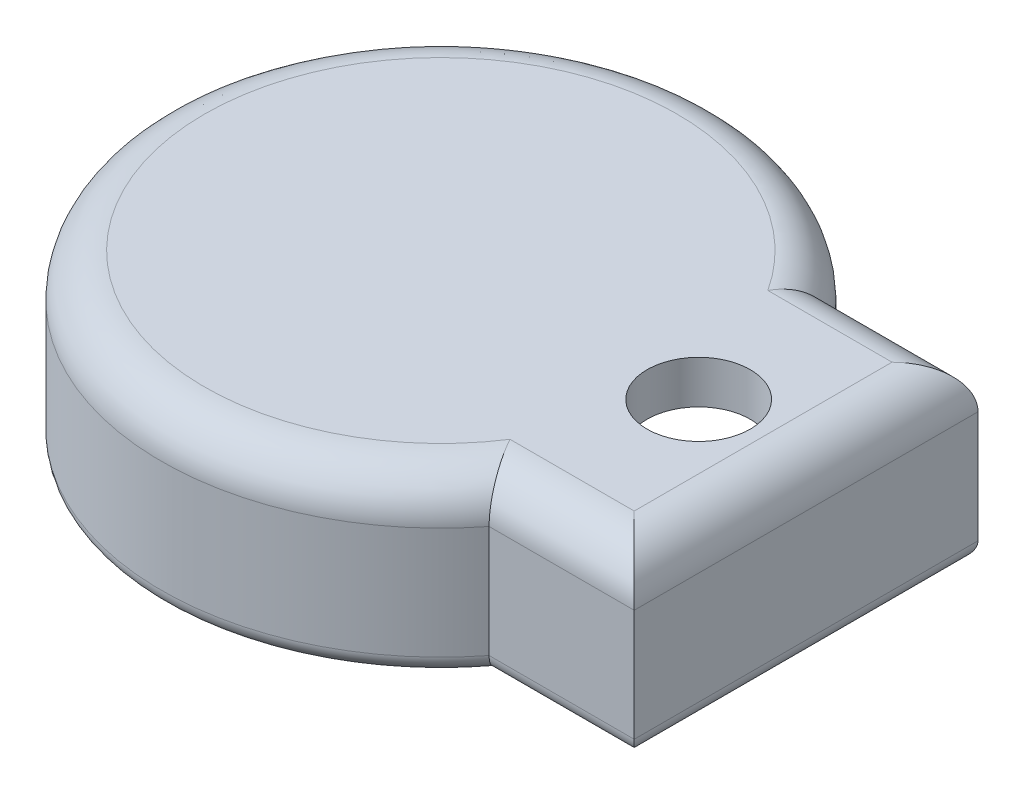
ISO-10303-21;
HEADER;
FILE_DESCRIPTION(('STEP AP214'),'2;1');
FILE_NAME('part.step','',(''),(''),'','','');
FILE_SCHEMA(('AUTOMOTIVE_DESIGN { 1 0 10303 214 1 1 1 1 }'));
ENDSEC;
DATA;
#1=APPLICATION_CONTEXT('core data for automotive mechanical design processes');
#2=APPLICATION_PROTOCOL_DEFINITION('international standard','automotive_design',2000,#1);
#3=PRODUCT_CONTEXT('',#1,'mechanical');
#4=PRODUCT('Part','Part','',(#3));
#5=PRODUCT_RELATED_PRODUCT_CATEGORY('part','',(#4));
#6=PRODUCT_DEFINITION_FORMATION('','',#4);
#7=PRODUCT_DEFINITION_CONTEXT('part definition',#1,'design');
#8=PRODUCT_DEFINITION('design','',#6,#7);
#9=PRODUCT_DEFINITION_SHAPE('','',#8);
#10=(LENGTH_UNIT() NAMED_UNIT(*) SI_UNIT(.MILLI.,.METRE.));
#11=(NAMED_UNIT(*) PLANE_ANGLE_UNIT() SI_UNIT($,.RADIAN.));
#12=(NAMED_UNIT(*) SI_UNIT($,.STERADIAN.) SOLID_ANGLE_UNIT());
#13=UNCERTAINTY_MEASURE_WITH_UNIT(LENGTH_MEASURE(1.E-05),#10,'distance_accuracy_value','');
#14=(GEOMETRIC_REPRESENTATION_CONTEXT(3) GLOBAL_UNCERTAINTY_ASSIGNED_CONTEXT((#13)) GLOBAL_UNIT_ASSIGNED_CONTEXT((#10,
#11,#12)) REPRESENTATION_CONTEXT('',''));
#15=CARTESIAN_POINT('',(0.,0.,0.));
#16=DIRECTION('',(0.,0.,1.));
#17=DIRECTION('',(1.,0.,0.));
#18=AXIS2_PLACEMENT_3D('',#15,#16,#17);
#19=CARTESIAN_POINT('',(0.,15.,-15.));
#20=DIRECTION('',(0.,0.,-1.));
#21=DIRECTION('',(-1.,0.,0.));
#22=AXIS2_PLACEMENT_3D('',#19,#20,#21);
#23=PLANE('',#22);
#24=DIRECTION('',(0.,-1.,0.));
#25=VECTOR('',#24,1.);
#26=CARTESIAN_POINT('',(23.0488611432322,15.,-15.));
#27=LINE('',#26,#25);
#28=CARTESIAN_POINT('',(23.0488611432322,15.,-15.));
#29=VERTEX_POINT('',#28);
#30=CARTESIAN_POINT('',(23.0488611432322,2.,-15.));
#31=VERTEX_POINT('',#30);
#32=EDGE_CURVE('E154',#29,#31,#27,.T.);
#33=ORIENTED_EDGE('',*,*,#32,.T.);
#34=DIRECTION('',(1.,0.,0.));
#35=VECTOR('',#34,1.);
#36=CARTESIAN_POINT('',(0.,2.,-15.));
#37=LINE('',#36,#35);
#38=CARTESIAN_POINT('',(37.5,2.,-15.));
#39=VERTEX_POINT('',#38);
#40=EDGE_CURVE('E356',#31,#39,#37,.T.);
#41=ORIENTED_EDGE('',*,*,#40,.T.);
#42=DIRECTION('',(0.,-1.,0.));
#43=VECTOR('',#42,1.);
#44=CARTESIAN_POINT('',(37.5,15.,-15.));
#45=LINE('',#44,#43);
#46=CARTESIAN_POINT('',(37.5,15.,-15.));
#47=VERTEX_POINT('',#46);
#48=EDGE_CURVE('E164',#47,#39,#45,.T.);
#49=ORIENTED_EDGE('',*,*,#48,.F.);
#50=DIRECTION('',(1.,0.,0.));
#51=VECTOR('',#50,1.);
#52=CARTESIAN_POINT('',(0.,15.,-15.));
#53=LINE('',#52,#51);
#54=EDGE_CURVE('E144',#29,#47,#53,.T.);
#55=ORIENTED_EDGE('',*,*,#54,.F.);
#56=EDGE_LOOP('',(#33,#41,#49,#55));
#57=FACE_BOUND('',#56,.T.);
#58=ADVANCED_FACE('F36',(#57),#23,.F.);
#59=CARTESIAN_POINT('',(37.5,15.,0.));
#60=DIRECTION('',(-1.,0.,0.));
#61=DIRECTION('',(0.,0.,1.));
#62=AXIS2_PLACEMENT_3D('',#59,#60,#61);
#63=PLANE('',#62);
#64=ORIENTED_EDGE('',*,*,#48,.T.);
#65=DIRECTION('',(0.,0.,-1.));
#66=VECTOR('',#65,1.);
#67=CARTESIAN_POINT('',(37.5,2.,15.));
#68=LINE('',#67,#66);
#69=CARTESIAN_POINT('',(37.5,2.,15.));
#70=VERTEX_POINT('',#69);
#71=EDGE_CURVE('E369',#39,#70,#68,.F.);
#72=ORIENTED_EDGE('',*,*,#71,.T.);
#73=DIRECTION('',(0.,-1.,0.));
#74=VECTOR('',#73,1.);
#75=CARTESIAN_POINT('',(37.5,15.,15.));
#76=LINE('',#75,#74);
#77=CARTESIAN_POINT('',(37.5,15.,15.));
#78=VERTEX_POINT('',#77);
#79=EDGE_CURVE('E177',#78,#70,#76,.T.);
#80=ORIENTED_EDGE('',*,*,#79,.F.);
#81=DIRECTION('',(0.,0.,-1.));
#82=VECTOR('',#81,1.);
#83=CARTESIAN_POINT('',(37.5,15.,0.));
#84=LINE('',#83,#82);
#85=EDGE_CURVE('E166',#78,#47,#84,.T.);
#86=ORIENTED_EDGE('',*,*,#85,.T.);
#87=EDGE_LOOP('',(#64,#72,#80,#86));
#88=FACE_BOUND('',#87,.T.);
#89=ADVANCED_FACE('F311',(#88),#63,.T.);
#90=CARTESIAN_POINT('',(0.,15.,15.));
#91=DIRECTION('',(0.,0.,-1.));
#92=DIRECTION('',(-1.,0.,0.));
#93=AXIS2_PLACEMENT_3D('',#90,#91,#92);
#94=PLANE('',#93);
#95=ORIENTED_EDGE('',*,*,#79,.T.);
#96=DIRECTION('',(1.,0.,0.));
#97=VECTOR('',#96,1.);
#98=CARTESIAN_POINT('',(23.0488611432322,2.,15.));
#99=LINE('',#98,#97);
#100=CARTESIAN_POINT('',(23.0488611432322,2.,15.));
#101=VERTEX_POINT('',#100);
#102=EDGE_CURVE('E373',#70,#101,#99,.F.);
#103=ORIENTED_EDGE('',*,*,#102,.T.);
#104=DIRECTION('',(0.,-1.,0.));
#105=VECTOR('',#104,1.);
#106=CARTESIAN_POINT('',(23.0488611432322,15.,15.));
#107=LINE('',#106,#105);
#108=CARTESIAN_POINT('',(23.0488611432322,15.,15.));
#109=VERTEX_POINT('',#108);
#110=EDGE_CURVE('E160',#109,#101,#107,.T.);
#111=ORIENTED_EDGE('',*,*,#110,.F.);
#112=DIRECTION('',(1.,0.,0.));
#113=VECTOR('',#112,1.);
#114=CARTESIAN_POINT('',(0.,15.,15.));
#115=LINE('',#114,#113);
#116=EDGE_CURVE('E147',#109,#78,#115,.T.);
#117=ORIENTED_EDGE('',*,*,#116,.T.);
#118=EDGE_LOOP('',(#95,#103,#111,#117));
#119=FACE_BOUND('',#118,.T.);
#120=ADVANCED_FACE('F316',(#119),#94,.T.);
#121=CARTESIAN_POINT('',(0.,15.,-20.));
#122=DIRECTION('',(0.,0.,-1.));
#123=DIRECTION('',(-1.,0.,0.));
#124=AXIS2_PLACEMENT_3D('',#121,#122,#123);
#125=PLANE('',#124);
#126=DIRECTION('',(0.,-1.,0.));
#127=VECTOR('',#126,1.);
#128=CARTESIAN_POINT('',(42.5,15.,-20.));
#129=LINE('',#128,#127);
#130=CARTESIAN_POINT('',(42.5,15.,-20.));
#131=VERTEX_POINT('',#130);
#132=CARTESIAN_POINT('',(42.5,2.,-20.));
#133=VERTEX_POINT('',#132);
#134=EDGE_CURVE('E151',#131,#133,#129,.T.);
#135=ORIENTED_EDGE('',*,*,#134,.T.);
#136=DIRECTION('',(1.,0.,0.));
#137=VECTOR('',#136,1.);
#138=CARTESIAN_POINT('',(25.617376914899,2.,-20.));
#139=LINE('',#138,#137);
#140=CARTESIAN_POINT('',(25.617376914899,2.,-20.));
#141=VERTEX_POINT('',#140);
#142=EDGE_CURVE('E11',#133,#141,#139,.F.);
#143=ORIENTED_EDGE('',*,*,#142,.T.);
#144=DIRECTION('',(0.,-1.,0.));
#145=VECTOR('',#144,1.);
#146=CARTESIAN_POINT('',(25.617376914899,15.,-20.));
#147=LINE('',#146,#145);
#148=CARTESIAN_POINT('',(25.617376914899,15.,-20.));
#149=VERTEX_POINT('',#148);
#150=EDGE_CURVE('E161',#149,#141,#147,.T.);
#151=ORIENTED_EDGE('',*,*,#150,.F.);
#152=DIRECTION('',(-1.,0.,0.));
#153=VECTOR('',#152,1.);
#154=CARTESIAN_POINT('',(0.,15.,-20.));
#155=LINE('',#154,#153);
#156=EDGE_CURVE('E202',#149,#131,#155,.F.);
#157=ORIENTED_EDGE('',*,*,#156,.T.);
#158=EDGE_LOOP('',(#135,#143,#151,#157));
#159=FACE_BOUND('',#158,.T.);
#160=ADVANCED_FACE('F329',(#159),#125,.T.);
#161=CARTESIAN_POINT('',(0.,15.,0.));
#162=DIRECTION('',(0.,-1.,0.));
#163=DIRECTION('',(0.,0.,-1.));
#164=AXIS2_PLACEMENT_3D('',#161,#162,#163);
#165=CYLINDRICAL_SURFACE('',#164,32.5);
#166=ORIENTED_EDGE('',*,*,#150,.T.);
#167=CARTESIAN_POINT('',(0.,2.,0.));
#168=DIRECTION('',(0.,1.,0.));
#169=DIRECTION('',(0.,0.,1.));
#170=AXIS2_PLACEMENT_3D('',#167,#168,#169);
#171=CIRCLE('',#170,32.5);
#172=CARTESIAN_POINT('',(25.617376914899,2.,20.));
#173=VERTEX_POINT('',#172);
#174=EDGE_CURVE('E353',#141,#173,#171,.T.);
#175=ORIENTED_EDGE('',*,*,#174,.T.);
#176=DIRECTION('',(0.,-1.,0.));
#177=VECTOR('',#176,1.);
#178=CARTESIAN_POINT('',(25.617376914899,15.,20.));
#179=LINE('',#178,#177);
#180=CARTESIAN_POINT('',(25.617376914899,15.,20.));
#181=VERTEX_POINT('',#180);
#182=EDGE_CURVE('E185',#181,#173,#179,.T.);
#183=ORIENTED_EDGE('',*,*,#182,.F.);
#184=CARTESIAN_POINT('',(0.,15.,0.));
#185=DIRECTION('',(0.,1.,0.));
#186=DIRECTION('',(0.,0.,1.));
#187=AXIS2_PLACEMENT_3D('',#184,#185,#186);
#188=CIRCLE('',#187,32.5);
#189=EDGE_CURVE('E204',#181,#149,#188,.F.);
#190=ORIENTED_EDGE('',*,*,#189,.T.);
#191=EDGE_LOOP('',(#166,#175,#183,#190));
#192=FACE_BOUND('',#191,.T.);
#193=ADVANCED_FACE('F327',(#192),#165,.T.);
#194=CARTESIAN_POINT('',(0.,15.,20.));
#195=DIRECTION('',(0.,0.,-1.));
#196=DIRECTION('',(-1.,0.,0.));
#197=AXIS2_PLACEMENT_3D('',#194,#195,#196);
#198=PLANE('',#197);
#199=ORIENTED_EDGE('',*,*,#182,.T.);
#200=DIRECTION('',(1.,0.,0.));
#201=VECTOR('',#200,1.);
#202=CARTESIAN_POINT('',(0.,2.,20.));
#203=LINE('',#202,#201);
#204=CARTESIAN_POINT('',(42.5,2.,20.));
#205=VERTEX_POINT('',#204);
#206=EDGE_CURVE('E60',#173,#205,#203,.T.);
#207=ORIENTED_EDGE('',*,*,#206,.T.);
#208=DIRECTION('',(0.,-1.,0.));
#209=VECTOR('',#208,1.);
#210=CARTESIAN_POINT('',(42.5,15.,20.));
#211=LINE('',#210,#209);
#212=CARTESIAN_POINT('',(42.5,15.,20.));
#213=VERTEX_POINT('',#212);
#214=EDGE_CURVE('E183',#213,#205,#211,.T.);
#215=ORIENTED_EDGE('',*,*,#214,.F.);
#216=DIRECTION('',(1.,0.,0.));
#217=VECTOR('',#216,1.);
#218=CARTESIAN_POINT('',(25.617376914899,15.,20.));
#219=LINE('',#218,#217);
#220=EDGE_CURVE('E197',#213,#181,#219,.F.);
#221=ORIENTED_EDGE('',*,*,#220,.T.);
#222=EDGE_LOOP('',(#199,#207,#215,#221));
#223=FACE_BOUND('',#222,.T.);
#224=ADVANCED_FACE('F324',(#223),#198,.F.);
#225=CARTESIAN_POINT('',(42.5,15.,0.));
#226=DIRECTION('',(-1.,0.,0.));
#227=DIRECTION('',(0.,0.,1.));
#228=AXIS2_PLACEMENT_3D('',#225,#226,#227);
#229=PLANE('',#228);
#230=ORIENTED_EDGE('',*,*,#214,.T.);
#231=DIRECTION('',(0.,0.,-1.));
#232=VECTOR('',#231,1.);
#233=CARTESIAN_POINT('',(42.5,2.,0.));
#234=LINE('',#233,#232);
#235=EDGE_CURVE('E45',#205,#133,#234,.T.);
#236=ORIENTED_EDGE('',*,*,#235,.T.);
#237=ORIENTED_EDGE('',*,*,#134,.F.);
#238=DIRECTION('',(0.,0.,-1.));
#239=VECTOR('',#238,1.);
#240=CARTESIAN_POINT('',(42.5,15.,20.));
#241=LINE('',#240,#239);
#242=EDGE_CURVE('E200',#131,#213,#241,.F.);
#243=ORIENTED_EDGE('',*,*,#242,.T.);
#244=EDGE_LOOP('',(#230,#236,#237,#243));
#245=FACE_BOUND('',#244,.T.);
#246=ADVANCED_FACE('F321',(#245),#229,.F.);
#247=CARTESIAN_POINT('',(0.,15.,0.));
#248=DIRECTION('',(0.,-1.,0.));
#249=DIRECTION('',(0.,0.,-1.));
#250=AXIS2_PLACEMENT_3D('',#247,#248,#249);
#251=CYLINDRICAL_SURFACE('',#250,27.5);
#252=ORIENTED_EDGE('',*,*,#110,.T.);
#253=CARTESIAN_POINT('',(0.,2.,0.));
#254=DIRECTION('',(0.,1.,0.));
#255=DIRECTION('',(0.,0.,1.));
#256=AXIS2_PLACEMENT_3D('',#253,#254,#255);
#257=CIRCLE('',#256,27.5);
#258=EDGE_CURVE('E157',#101,#31,#257,.F.);
#259=ORIENTED_EDGE('',*,*,#258,.T.);
#260=ORIENTED_EDGE('',*,*,#32,.F.);
#261=CARTESIAN_POINT('',(0.,15.,0.));
#262=DIRECTION('',(0.,1.,0.));
#263=DIRECTION('',(0.,0.,1.));
#264=AXIS2_PLACEMENT_3D('',#261,#262,#263);
#265=CIRCLE('',#264,27.5);
#266=EDGE_CURVE('E139',#29,#109,#265,.T.);
#267=ORIENTED_EDGE('',*,*,#266,.T.);
#268=EDGE_LOOP('',(#252,#259,#260,#267));
#269=FACE_BOUND('',#268,.T.);
#270=ADVANCED_FACE('F155',(#269),#251,.F.);
#271=CARTESIAN_POINT('',(0.,0.,0.));
#272=DIRECTION('',(0.,1.,0.));
#273=DIRECTION('',(0.,0.,1.));
#274=AXIS2_PLACEMENT_3D('',#271,#272,#273);
#275=PLANE('',#274);
#276=DIRECTION('',(1.,0.,0.));
#277=VECTOR('',#276,1.);
#278=CARTESIAN_POINT('',(37.5,0.,17.));
#279=LINE('',#278,#277);
#280=CARTESIAN_POINT('',(24.1091269024824,0.,16.9999999999999));
#281=VERTEX_POINT('',#280);
#282=CARTESIAN_POINT('',(39.5,0.,17.));
#283=VERTEX_POINT('',#282);
#284=EDGE_CURVE('E383',#281,#283,#279,.T.);
#285=ORIENTED_EDGE('',*,*,#284,.T.);
#286=DIRECTION('',(0.,0.,-1.));
#287=VECTOR('',#286,1.);
#288=CARTESIAN_POINT('',(39.5,0.,-15.));
#289=LINE('',#288,#287);
#290=CARTESIAN_POINT('',(39.5,0.,-17.));
#291=VERTEX_POINT('',#290);
#292=EDGE_CURVE('E371',#283,#291,#289,.T.);
#293=ORIENTED_EDGE('',*,*,#292,.T.);
#294=DIRECTION('',(1.,0.,0.));
#295=VECTOR('',#294,1.);
#296=CARTESIAN_POINT('',(0.,0.,-17.));
#297=LINE('',#296,#295);
#298=CARTESIAN_POINT('',(24.1091269024824,0.,-17.));
#299=VERTEX_POINT('',#298);
#300=EDGE_CURVE('E387',#291,#299,#297,.F.);
#301=ORIENTED_EDGE('',*,*,#300,.T.);
#302=CARTESIAN_POINT('',(0.,0.,0.));
#303=DIRECTION('',(0.,1.,0.));
#304=DIRECTION('',(0.,0.,1.));
#305=AXIS2_PLACEMENT_3D('',#302,#303,#304);
#306=CIRCLE('',#305,29.5);
#307=EDGE_CURVE('E385',#299,#281,#306,.T.);
#308=ORIENTED_EDGE('',*,*,#307,.T.);
#309=EDGE_LOOP('',(#285,#293,#301,#308));
#310=FACE_BOUND('',#309,.T.);
#311=DIRECTION('',(1.,0.,0.));
#312=VECTOR('',#311,1.);
#313=CARTESIAN_POINT('',(0.,0.,18.));
#314=LINE('',#313,#312);
#315=CARTESIAN_POINT('',(40.5,0.,18.));
#316=VERTEX_POINT('',#315);
#317=CARTESIAN_POINT('',(24.6221445044903,0.,18.));
#318=VERTEX_POINT('',#317);
#319=EDGE_CURVE('E391',#316,#318,#314,.F.);
#320=ORIENTED_EDGE('',*,*,#319,.T.);
#321=CARTESIAN_POINT('',(0.,0.,0.));
#322=DIRECTION('',(0.,1.,0.));
#323=DIRECTION('',(0.,0.,1.));
#324=AXIS2_PLACEMENT_3D('',#321,#322,#323);
#325=CIRCLE('',#324,30.5);
#326=CARTESIAN_POINT('',(24.6221445044903,0.,-18.));
#327=VERTEX_POINT('',#326);
#328=EDGE_CURVE('E389',#318,#327,#325,.F.);
#329=ORIENTED_EDGE('',*,*,#328,.T.);
#330=DIRECTION('',(1.,0.,0.));
#331=VECTOR('',#330,1.);
#332=CARTESIAN_POINT('',(42.5,0.,-18.));
#333=LINE('',#332,#331);
#334=CARTESIAN_POINT('',(40.5,0.,-18.));
#335=VERTEX_POINT('',#334);
#336=EDGE_CURVE('E206',#327,#335,#333,.T.);
#337=ORIENTED_EDGE('',*,*,#336,.T.);
#338=DIRECTION('',(0.,0.,-1.));
#339=VECTOR('',#338,1.);
#340=CARTESIAN_POINT('',(40.5,0.,0.));
#341=LINE('',#340,#339);
#342=EDGE_CURVE('E345',#335,#316,#341,.F.);
#343=ORIENTED_EDGE('',*,*,#342,.T.);
#344=EDGE_LOOP('',(#320,#329,#337,#343));
#345=FACE_BOUND('',#344,.T.);
#346=ADVANCED_FACE('F393',(#310,#345),#275,.F.);
#347=CARTESIAN_POINT('',(0.,20.,0.));
#348=DIRECTION('',(0.,1.,0.));
#349=DIRECTION('',(0.,0.,1.));
#350=AXIS2_PLACEMENT_3D('',#347,#348,#349);
#351=PLANE('',#350);
#352=CARTESIAN_POINT('',(0.,20.,0.));
#353=DIRECTION('',(0.,1.,0.));
#354=DIRECTION('',(0.,0.,1.));
#355=AXIS2_PLACEMENT_3D('',#352,#353,#354);
#356=CIRCLE('',#355,27.5);
#357=CARTESIAN_POINT('',(23.0488611432322,20.,-15.));
#358=VERTEX_POINT('',#357);
#359=CARTESIAN_POINT('',(23.0488611432322,20.,15.));
#360=VERTEX_POINT('',#359);
#361=EDGE_CURVE('E181',#358,#360,#356,.T.);
#362=ORIENTED_EDGE('',*,*,#361,.T.);
#363=DIRECTION('',(1.,0.,0.));
#364=VECTOR('',#363,1.);
#365=CARTESIAN_POINT('',(42.5,20.,15.));
#366=LINE('',#365,#364);
#367=CARTESIAN_POINT('',(37.5,20.,15.));
#368=VERTEX_POINT('',#367);
#369=EDGE_CURVE('E194',#360,#368,#366,.T.);
#370=ORIENTED_EDGE('',*,*,#369,.T.);
#371=DIRECTION('',(0.,0.,-1.));
#372=VECTOR('',#371,1.);
#373=CARTESIAN_POINT('',(37.5,20.,-20.));
#374=LINE('',#373,#372);
#375=CARTESIAN_POINT('',(37.5,20.,-15.));
#376=VERTEX_POINT('',#375);
#377=EDGE_CURVE('E192',#368,#376,#374,.T.);
#378=ORIENTED_EDGE('',*,*,#377,.T.);
#379=DIRECTION('',(-1.,0.,0.));
#380=VECTOR('',#379,1.);
#381=CARTESIAN_POINT('',(0.,20.,-15.));
#382=LINE('',#381,#380);
#383=EDGE_CURVE('E190',#376,#358,#382,.T.);
#384=ORIENTED_EDGE('',*,*,#383,.T.);
#385=EDGE_LOOP('',(#362,#370,#378,#384));
#386=FACE_BOUND('',#385,.T.);
#387=CARTESIAN_POINT('',(30.,20.,0.));
#388=DIRECTION('',(0.,1.,0.));
#389=DIRECTION('',(0.,0.,1.));
#390=AXIS2_PLACEMENT_3D('',#387,#388,#389);
#391=CIRCLE('',#390,6.);
#392=CARTESIAN_POINT('',(30.,20.,6.));
#393=VERTEX_POINT('',#392);
#394=EDGE_CURVE('E167',#393,#393,#391,.T.);
#395=ORIENTED_EDGE('',*,*,#394,.F.);
#396=EDGE_LOOP('',(#395));
#397=FACE_BOUND('',#396,.T.);
#398=ADVANCED_FACE('F396',(#386,#397),#351,.T.);
#399=CARTESIAN_POINT('',(0.,15.,0.));
#400=DIRECTION('',(0.,1.,0.));
#401=DIRECTION('',(0.,0.,1.));
#402=AXIS2_PLACEMENT_3D('',#399,#400,#401);
#403=PLANE('',#402);
#404=ORIENTED_EDGE('',*,*,#266,.F.);
#405=ORIENTED_EDGE('',*,*,#54,.T.);
#406=ORIENTED_EDGE('',*,*,#85,.F.);
#407=ORIENTED_EDGE('',*,*,#116,.F.);
#408=EDGE_LOOP('',(#404,#405,#406,#407));
#409=FACE_BOUND('',#408,.T.);
#410=CARTESIAN_POINT('',(30.,15.,0.));
#411=DIRECTION('',(0.,1.,0.));
#412=DIRECTION('',(0.,0.,1.));
#413=AXIS2_PLACEMENT_3D('',#410,#411,#412);
#414=CIRCLE('',#413,6.);
#415=CARTESIAN_POINT('',(30.,15.,6.));
#416=VERTEX_POINT('',#415);
#417=EDGE_CURVE('E171',#416,#416,#414,.T.);
#418=ORIENTED_EDGE('',*,*,#417,.T.);
#419=EDGE_LOOP('',(#418));
#420=FACE_BOUND('',#419,.T.);
#421=ADVANCED_FACE('F141',(#409,#420),#403,.F.);
#422=CARTESIAN_POINT('',(30.,20.,0.));
#423=DIRECTION('',(0.,-1.,0.));
#424=DIRECTION('',(0.,0.,-1.));
#425=AXIS2_PLACEMENT_3D('',#422,#423,#424);
#426=CYLINDRICAL_SURFACE('',#425,6.);
#427=ORIENTED_EDGE('',*,*,#394,.T.);
#428=EDGE_LOOP('',(#427));
#429=FACE_BOUND('',#428,.T.);
#430=ORIENTED_EDGE('',*,*,#417,.F.);
#431=EDGE_LOOP('',(#430));
#432=FACE_BOUND('',#431,.T.);
#433=ADVANCED_FACE('F243',(#429,#432),#426,.F.);
#434=CARTESIAN_POINT('',(0.,15.,-15.));
#435=DIRECTION('',(-1.,0.,0.));
#436=DIRECTION('',(0.,0.,1.));
#437=AXIS2_PLACEMENT_3D('',#434,#435,#436);
#438=CYLINDRICAL_SURFACE('',#437,5.);
#439=CARTESIAN_POINT('',(37.5,15.,-15.));
#440=DIRECTION('',(-0.707106781186547,0.,-0.707106781186548));
#441=DIRECTION('',(-0.707106781186548,0.,0.707106781186547));
#442=AXIS2_PLACEMENT_3D('',#439,#440,#441);
#443=ELLIPSE('',#442,7.07106781186547,5.);
#444=EDGE_CURVE('E218',#131,#376,#443,.F.);
#445=ORIENTED_EDGE('',*,*,#444,.F.);
#446=ORIENTED_EDGE('',*,*,#156,.F.);
#447=CARTESIAN_POINT('',(25.617376914899,15.,-20.));
#448=CARTESIAN_POINT('',(25.6173857838936,15.1301574691726,-20.0000212756672));
#449=CARTESIAN_POINT('',(25.6148974325937,15.2603079780687,-19.994918664603));
#450=CARTESIAN_POINT('',(25.6049916567104,15.5196003115881,-19.9746221015799));
#451=CARTESIAN_POINT('',(25.5975754258292,15.6487423728291,-19.9594305934996));
#452=CARTESIAN_POINT('',(25.5779113114661,15.9046690859686,-19.9191782616975));
#453=CARTESIAN_POINT('',(25.5656792612904,16.0314600515766,-19.8941497801387));
#454=CARTESIAN_POINT('',(25.5365046865333,16.2822156230645,-19.8345143045355));
#455=CARTESIAN_POINT('',(25.5195620437217,16.40618015792,-19.7999070700763));
#456=CARTESIAN_POINT('',(25.48113882311,16.6503497348984,-19.7215227080585));
#457=CARTESIAN_POINT('',(25.4596614430864,16.7705573580791,-19.677752042492));
#458=CARTESIAN_POINT('',(25.4123465021245,17.0065809427881,-19.5814718050502));
#459=CARTESIAN_POINT('',(25.3865073180463,17.1223952497285,-19.5289589800923));
#460=CARTESIAN_POINT('',(25.3306925859317,17.3489097847921,-19.4157283419108));
#461=CARTESIAN_POINT('',(25.3007166918757,17.4596095840718,-19.3550098423236));
#462=CARTESIAN_POINT('',(25.2368606604136,17.6753259788688,-19.2259246504409));
#463=CARTESIAN_POINT('',(25.2029790354165,17.7803403864398,-19.1575550443303));
#464=CARTESIAN_POINT('',(25.1302251268013,17.9879804576976,-19.0110737462258));
#465=CARTESIAN_POINT('',(25.0912128171698,18.0903666667628,-18.9326918869898));
#466=CARTESIAN_POINT('',(25.0095579395833,18.2879661877444,-18.769052721376));
#467=CARTESIAN_POINT('',(24.9669140654547,18.3831768954249,-18.6837929417866));
#468=CARTESIAN_POINT('',(24.8339943447401,18.6573863386179,-18.4187778189351));
#469=CARTESIAN_POINT('',(24.7386786495909,18.8251089886703,-18.2296822104302));
#470=CARTESIAN_POINT('',(24.5274878450714,19.1424195146884,-17.8134191922525));
#471=CARTESIAN_POINT('',(24.4105185977391,19.2887454875378,-17.5843405107888));
#472=CARTESIAN_POINT('',(24.1663090806044,19.541023861571,-17.1098232351402));
#473=CARTESIAN_POINT('',(24.0390604905422,19.6469431520338,-16.8643714168553));
#474=CARTESIAN_POINT('',(23.7720373230469,19.8211323428686,-16.3536495346581));
#475=CARTESIAN_POINT('',(23.631967168955,19.8877619438659,-16.0879797458721));
#476=CARTESIAN_POINT('',(23.3469621752484,19.9767756252459,-15.5524162972688));
#477=CARTESIAN_POINT('',(23.2020379313008,19.9992504071364,-15.28253244649));
#478=CARTESIAN_POINT('',(23.0537703062967,19.9999938656752,-15.0090527667387));
#479=CARTESIAN_POINT('',(23.051315846707,20.0000000121101,-15.0045262436169));
#480=CARTESIAN_POINT('',(23.0488611432322,20.,-15.));
#481=B_SPLINE_CURVE_WITH_KNOTS('',3,(#447,#448,#449,#450,#451,#452,#453,#454,#455,#456,#457,
#458,#459,#460,#461,#462,#463,#464,#465,#466,#467,#468,#469,#470,#471,#472,#473,#474,#475,#476,
#477,#478,#479,#480),.UNSPECIFIED.,.F.,.F.,(4,2,2,2,2,2,2,2,2,2,2,2,2,2,2,2,4),(0.,
0.390337938789421,0.78058135874431,1.16955232110441,1.5585330470352,1.94724038474726,
2.33609269066043,2.72497754227661,3.11401100242955,3.51771642271749,3.92156766295273,
4.72871426523384,5.6129491547215,6.49790707029822,7.41758775308276,8.33537727183109,
8.35082472614305),.UNSPECIFIED.);
#482=EDGE_CURVE('E232',#358,#149,#481,.F.);
#483=ORIENTED_EDGE('',*,*,#482,.F.);
#484=ORIENTED_EDGE('',*,*,#383,.F.);
#485=EDGE_LOOP('',(#445,#446,#483,#484));
#486=FACE_BOUND('',#485,.T.);
#487=ADVANCED_FACE('F228',(#486),#438,.T.);
#488=CARTESIAN_POINT('',(0.,15.,0.));
#489=DIRECTION('',(0.,1.,0.));
#490=DIRECTION('',(0.,0.,1.));
#491=AXIS2_PLACEMENT_3D('',#488,#489,#490);
#492=TOROIDAL_SURFACE('',#491,27.5,5.);
#493=ORIENTED_EDGE('',*,*,#482,.T.);
#494=ORIENTED_EDGE('',*,*,#189,.F.);
#495=CARTESIAN_POINT('',(25.617376914899,15.,20.));
#496=CARTESIAN_POINT('',(25.6173857838936,15.1301574691726,20.0000212756672));
#497=CARTESIAN_POINT('',(25.6148974325937,15.2603079780687,19.994918664603));
#498=CARTESIAN_POINT('',(25.6049916567104,15.5196003115881,19.9746221015799));
#499=CARTESIAN_POINT('',(25.5975754258292,15.6487423728291,19.9594305934996));
#500=CARTESIAN_POINT('',(25.5779113114661,15.9046690859686,19.9191782616975));
#501=CARTESIAN_POINT('',(25.5656792612904,16.0314600515766,19.8941497801387));
#502=CARTESIAN_POINT('',(25.5365046865333,16.2822156230645,19.8345143045355));
#503=CARTESIAN_POINT('',(25.5195620437217,16.40618015792,19.7999070700763));
#504=CARTESIAN_POINT('',(25.48113882311,16.6503497348984,19.7215227080585));
#505=CARTESIAN_POINT('',(25.4596614430864,16.7705573580791,19.677752042492));
#506=CARTESIAN_POINT('',(25.4123465021245,17.0065809427881,19.5814718050502));
#507=CARTESIAN_POINT('',(25.3865073180463,17.1223952497285,19.5289589800923));
#508=CARTESIAN_POINT('',(25.3306925859317,17.3489097847921,19.4157283419108));
#509=CARTESIAN_POINT('',(25.3007166918757,17.4596095840718,19.3550098423236));
#510=CARTESIAN_POINT('',(25.2368606604136,17.6753259788688,19.2259246504409));
#511=CARTESIAN_POINT('',(25.2029790354165,17.7803403864398,19.1575550443303));
#512=CARTESIAN_POINT('',(25.1302251268013,17.9879804576976,19.0110737462258));
#513=CARTESIAN_POINT('',(25.0912128171698,18.0903666667628,18.9326918869898));
#514=CARTESIAN_POINT('',(25.0095579395833,18.2879661877444,18.769052721376));
#515=CARTESIAN_POINT('',(24.9669140654547,18.3831768954249,18.6837929417866));
#516=CARTESIAN_POINT('',(24.8339943447401,18.6573863386179,18.4187778189351));
#517=CARTESIAN_POINT('',(24.7386786495909,18.8251089886703,18.2296822104302));
#518=CARTESIAN_POINT('',(24.5274878450714,19.1424195146884,17.8134191922525));
#519=CARTESIAN_POINT('',(24.4105185977391,19.2887454875378,17.5843405107888));
#520=CARTESIAN_POINT('',(24.1663090806044,19.541023861571,17.1098232351402));
#521=CARTESIAN_POINT('',(24.0390604905422,19.6469431520338,16.8643714168553));
#522=CARTESIAN_POINT('',(23.7720373230469,19.8211323428686,16.3536495346581));
#523=CARTESIAN_POINT('',(23.631967168955,19.8877619438659,16.0879797458721));
#524=CARTESIAN_POINT('',(23.3469621752484,19.9767756252459,15.5524162972688));
#525=CARTESIAN_POINT('',(23.2020379313009,19.9992504071364,15.28253244649));
#526=CARTESIAN_POINT('',(23.0537703062967,19.9999938656752,15.0090527667387));
#527=CARTESIAN_POINT('',(23.051315846707,20.0000000121101,15.0045262436169));
#528=CARTESIAN_POINT('',(23.0488611432322,20.,15.));
#529=B_SPLINE_CURVE_WITH_KNOTS('',3,(#495,#496,#497,#498,#499,#500,#501,#502,#503,#504,#505,
#506,#507,#508,#509,#510,#511,#512,#513,#514,#515,#516,#517,#518,#519,#520,#521,#522,#523,#524,
#525,#526,#527,#528),.UNSPECIFIED.,.F.,.F.,(4,2,2,2,2,2,2,2,2,2,2,2,2,2,2,2,4),(0.,
0.390337938789421,0.78058135874431,1.16955232110441,1.5585330470352,1.94724038474726,
2.33609269066043,2.72497754227662,3.11401100242955,3.51771642271749,3.92156766295272,
4.72871426523383,5.6129491547215,6.49790707029823,7.41758775308277,8.3353772718311,
8.35082472614306),.UNSPECIFIED.);
#530=EDGE_CURVE('E209',#360,#181,#529,.F.);
#531=ORIENTED_EDGE('',*,*,#530,.F.);
#532=ORIENTED_EDGE('',*,*,#361,.F.);
#533=EDGE_LOOP('',(#493,#494,#531,#532));
#534=FACE_BOUND('',#533,.T.);
#535=ADVANCED_FACE('F223',(#534),#492,.T.);
#536=CARTESIAN_POINT('',(37.5,15.,0.));
#537=DIRECTION('',(0.,0.,1.));
#538=DIRECTION('',(1.,0.,0.));
#539=AXIS2_PLACEMENT_3D('',#536,#537,#538);
#540=CYLINDRICAL_SURFACE('',#539,5.);
#541=ORIENTED_EDGE('',*,*,#444,.T.);
#542=ORIENTED_EDGE('',*,*,#377,.F.);
#543=CARTESIAN_POINT('',(37.5,15.,15.));
#544=DIRECTION('',(-0.707106781186547,0.,0.707106781186547));
#545=DIRECTION('',(0.707106781186547,0.,0.707106781186547));
#546=AXIS2_PLACEMENT_3D('',#543,#544,#545);
#547=ELLIPSE('',#546,7.07106781186547,5.);
#548=EDGE_CURVE('E207',#213,#368,#547,.T.);
#549=ORIENTED_EDGE('',*,*,#548,.F.);
#550=ORIENTED_EDGE('',*,*,#242,.F.);
#551=EDGE_LOOP('',(#541,#542,#549,#550));
#552=FACE_BOUND('',#551,.T.);
#553=ADVANCED_FACE('F227',(#552),#540,.T.);
#554=CARTESIAN_POINT('',(0.,15.,15.));
#555=DIRECTION('',(-1.,0.,0.));
#556=DIRECTION('',(0.,0.,1.));
#557=AXIS2_PLACEMENT_3D('',#554,#555,#556);
#558=CYLINDRICAL_SURFACE('',#557,5.);
#559=ORIENTED_EDGE('',*,*,#530,.T.);
#560=ORIENTED_EDGE('',*,*,#220,.F.);
#561=ORIENTED_EDGE('',*,*,#548,.T.);
#562=ORIENTED_EDGE('',*,*,#369,.F.);
#563=EDGE_LOOP('',(#559,#560,#561,#562));
#564=FACE_BOUND('',#563,.T.);
#565=ADVANCED_FACE('F220',(#564),#558,.T.);
#566=CARTESIAN_POINT('',(0.,2.,0.));
#567=DIRECTION('',(0.,1.,0.));
#568=DIRECTION('',(0.,0.,1.));
#569=AXIS2_PLACEMENT_3D('',#566,#567,#568);
#570=TOROIDAL_SURFACE('',#569,29.5,2.);
#571=CARTESIAN_POINT('',(23.0488611432322,2.,-15.));
#572=CARTESIAN_POINT('',(23.0488562531988,1.94856147165596,-14.9999915578662));
#573=CARTESIAN_POINT('',(23.0499372355086,1.89712777915228,-15.0019842299212));
#574=CARTESIAN_POINT('',(23.0542335429397,1.79466983552381,-15.0099070334213));
#575=CARTESIAN_POINT('',(23.0574482050106,1.74364546218508,-15.0158359416641));
#576=CARTESIAN_POINT('',(23.065957652886,1.64257375140979,-15.0315354168152));
#577=CARTESIAN_POINT('',(23.0712441618992,1.59252334802479,-15.0412906979288));
#578=CARTESIAN_POINT('',(23.0838229964816,1.49356127640304,-15.0645137899527));
#579=CARTESIAN_POINT('',(23.0911154013543,1.4446496532712,-15.0779817476447));
#580=CARTESIAN_POINT('',(23.1158621121199,1.30020609668239,-15.1237122599881));
#581=CARTESIAN_POINT('',(23.1362008447644,1.20679221883049,-15.1613289363926));
#582=CARTESIAN_POINT('',(23.1836418103485,1.02801793453944,-15.2492275339713));
#583=CARTESIAN_POINT('',(23.2107491524656,0.942663679158914,-15.2995190227952));
#584=CARTESIAN_POINT('',(23.2721350985058,0.777692927238135,-15.4136515059293));
#585=CARTESIAN_POINT('',(23.3066979786906,0.698556207038383,-15.478031798536));
#586=CARTESIAN_POINT('',(23.3808802303987,0.552144593997766,-15.6165673820116));
#587=CARTESIAN_POINT('',(23.4205009914458,0.484872972931623,-15.6907253592348));
#588=CARTESIAN_POINT('',(23.5084228482537,0.355957025455251,-15.8557520597908));
#589=CARTESIAN_POINT('',(23.5571983503506,0.2958418206739,-15.9475618958268));
#590=CARTESIAN_POINT('',(23.6581902769733,0.191885097617033,-16.1382965686812));
#591=CARTESIAN_POINT('',(23.7104097017543,0.148057995635323,-16.2372276163592));
#592=CARTESIAN_POINT('',(23.8191467288328,0.0756052168527896,-16.443946977073));
#593=CARTESIAN_POINT('',(23.8757527767334,0.0476786682378275,-16.5519322205739));
#594=CARTESIAN_POINT('',(23.989841586529,0.0101485563424514,-16.7703702538744));
#595=CARTESIAN_POINT('',(24.0473221324183,0.000504603394531089,-16.8808170577646));
#596=CARTESIAN_POINT('',(24.1060908342176,6.41599949588797E-06,-16.9941445176395));
#597=CARTESIAN_POINT('',(24.1076089560785,-1.32372039290264E-08,-16.9970722884173));
#598=CARTESIAN_POINT('',(24.1091269024824,0.,-17.));
#599=B_SPLINE_CURVE_WITH_KNOTS('',3,(#571,#572,#573,#574,#575,#576,#577,#578,#579,#580,#581,
#582,#583,#584,#585,#586,#587,#588,#589,#590,#591,#592,#593,#594,#595,#596,#597,#598),
.UNSPECIFIED.,.F.,.F.,(4,2,2,2,2,2,2,2,2,2,2,2,2,4),(0.,0.154257531022121,0.30846714826931,
0.462066894453412,0.615672714116511,0.922362900966855,1.22928529158579,1.55110918923339,
1.87302169083539,2.23183675451474,2.59096864658223,2.96486690261108,3.33793818060827,
3.34783204800693),.UNSPECIFIED.);
#600=EDGE_CURVE('E259',#31,#299,#599,.T.);
#601=ORIENTED_EDGE('',*,*,#600,.F.);
#602=ORIENTED_EDGE('',*,*,#258,.F.);
#603=CARTESIAN_POINT('',(23.0488611432322,2.,15.));
#604=CARTESIAN_POINT('',(23.0488562531988,1.94856147165596,14.9999915578662));
#605=CARTESIAN_POINT('',(23.0499372355086,1.89712777915228,15.0019842299212));
#606=CARTESIAN_POINT('',(23.0542335429397,1.79466983552381,15.0099070334213));
#607=CARTESIAN_POINT('',(23.0574482050106,1.74364546218508,15.0158359416641));
#608=CARTESIAN_POINT('',(23.065957652886,1.64257375140979,15.0315354168152));
#609=CARTESIAN_POINT('',(23.0712441618992,1.59252334802479,15.0412906979288));
#610=CARTESIAN_POINT('',(23.0838229964816,1.49356127640304,15.0645137899527));
#611=CARTESIAN_POINT('',(23.0911154013543,1.4446496532712,15.0779817476447));
#612=CARTESIAN_POINT('',(23.1158621121199,1.30020609668239,15.1237122599881));
#613=CARTESIAN_POINT('',(23.1362008447644,1.20679221883049,15.1613289363926));
#614=CARTESIAN_POINT('',(23.1836418103485,1.02801793453944,15.2492275339713));
#615=CARTESIAN_POINT('',(23.2107491524656,0.942663679158914,15.2995190227952));
#616=CARTESIAN_POINT('',(23.2721350985058,0.777692927238135,15.4136515059293));
#617=CARTESIAN_POINT('',(23.3066979786906,0.698556207038383,15.478031798536));
#618=CARTESIAN_POINT('',(23.3808802303987,0.552144593997766,15.6165673820116));
#619=CARTESIAN_POINT('',(23.4205009914458,0.484872972931623,15.6907253592348));
#620=CARTESIAN_POINT('',(23.5084228482537,0.355957025455251,15.8557520597908));
#621=CARTESIAN_POINT('',(23.5571983503506,0.2958418206739,15.9475618958268));
#622=CARTESIAN_POINT('',(23.6581902769733,0.191885097617033,16.1382965686812));
#623=CARTESIAN_POINT('',(23.7104097017543,0.148057995635323,16.2372276163592));
#624=CARTESIAN_POINT('',(23.8191467288328,0.0756052168527896,16.443946977073));
#625=CARTESIAN_POINT('',(23.8757527767334,0.0476786682378275,16.5519322205739));
#626=CARTESIAN_POINT('',(23.989841586529,0.0101485563424514,16.7703702538744));
#627=CARTESIAN_POINT('',(24.0473221324183,0.000504603394531089,16.8808170577646));
#628=CARTESIAN_POINT('',(24.1060908342176,6.41599949588797E-06,16.9941445176395));
#629=CARTESIAN_POINT('',(24.1076089560785,-1.32372039290264E-08,16.9970722884173));
#630=CARTESIAN_POINT('',(24.1091269024824,0.,17.));
#631=B_SPLINE_CURVE_WITH_KNOTS('',3,(#603,#604,#605,#606,#607,#608,#609,#610,#611,#612,#613,
#614,#615,#616,#617,#618,#619,#620,#621,#622,#623,#624,#625,#626,#627,#628,#629,#630),
.UNSPECIFIED.,.F.,.F.,(4,2,2,2,2,2,2,2,2,2,2,2,2,4),(0.,0.154257531022121,0.30846714826931,
0.462066894453412,0.615672714116511,0.922362900966855,1.22928529158579,1.55110918923339,
1.87302169083539,2.23183675451474,2.59096864658223,2.96486690261108,3.33793818060827,
3.34783204800693),.UNSPECIFIED.);
#632=EDGE_CURVE('E210',#281,#101,#631,.F.);
#633=ORIENTED_EDGE('',*,*,#632,.F.);
#634=ORIENTED_EDGE('',*,*,#307,.F.);
#635=EDGE_LOOP('',(#601,#602,#633,#634));
#636=FACE_BOUND('',#635,.T.);
#637=ADVANCED_FACE('F255',(#636),#570,.T.);
#638=CARTESIAN_POINT('',(0.,2.,17.));
#639=DIRECTION('',(-1.,0.,0.));
#640=DIRECTION('',(0.,0.,1.));
#641=AXIS2_PLACEMENT_3D('',#638,#639,#640);
#642=CYLINDRICAL_SURFACE('',#641,2.);
#643=ORIENTED_EDGE('',*,*,#632,.T.);
#644=ORIENTED_EDGE('',*,*,#102,.F.);
#645=CARTESIAN_POINT('',(39.5,2.,17.));
#646=DIRECTION('',(-0.707106781186547,0.,0.707106781186547));
#647=DIRECTION('',(0.707106781186547,0.,0.707106781186547));
#648=AXIS2_PLACEMENT_3D('',#645,#646,#647);
#649=ELLIPSE('',#648,2.82842712474619,2.);
#650=EDGE_CURVE('E267',#283,#70,#649,.F.);
#651=ORIENTED_EDGE('',*,*,#650,.F.);
#652=ORIENTED_EDGE('',*,*,#284,.F.);
#653=EDGE_LOOP('',(#643,#644,#651,#652));
#654=FACE_BOUND('',#653,.T.);
#655=ADVANCED_FACE('F253',(#654),#642,.T.);
#656=CARTESIAN_POINT('',(0.,2.,-17.));
#657=DIRECTION('',(1.,0.,0.));
#658=DIRECTION('',(0.,0.,-1.));
#659=AXIS2_PLACEMENT_3D('',#656,#657,#658);
#660=CYLINDRICAL_SURFACE('',#659,2.);
#661=ORIENTED_EDGE('',*,*,#600,.T.);
#662=ORIENTED_EDGE('',*,*,#300,.F.);
#663=CARTESIAN_POINT('',(39.5,2.,-17.));
#664=DIRECTION('',(0.707106781186547,0.,0.707106781186547));
#665=DIRECTION('',(-0.707106781186547,0.,0.707106781186547));
#666=AXIS2_PLACEMENT_3D('',#663,#664,#665);
#667=ELLIPSE('',#666,2.82842712474619,2.);
#668=EDGE_CURVE('E347',#39,#291,#667,.T.);
#669=ORIENTED_EDGE('',*,*,#668,.F.);
#670=ORIENTED_EDGE('',*,*,#40,.F.);
#671=EDGE_LOOP('',(#661,#662,#669,#670));
#672=FACE_BOUND('',#671,.T.);
#673=ADVANCED_FACE('F248',(#672),#660,.T.);
#674=CARTESIAN_POINT('',(39.5,2.,0.));
#675=DIRECTION('',(0.,0.,1.));
#676=DIRECTION('',(1.,0.,0.));
#677=AXIS2_PLACEMENT_3D('',#674,#675,#676);
#678=CYLINDRICAL_SURFACE('',#677,2.);
#679=ORIENTED_EDGE('',*,*,#650,.T.);
#680=ORIENTED_EDGE('',*,*,#71,.F.);
#681=ORIENTED_EDGE('',*,*,#668,.T.);
#682=ORIENTED_EDGE('',*,*,#292,.F.);
#683=EDGE_LOOP('',(#679,#680,#681,#682));
#684=FACE_BOUND('',#683,.T.);
#685=ADVANCED_FACE('F245',(#684),#678,.T.);
#686=CARTESIAN_POINT('',(40.5,2.,0.));
#687=DIRECTION('',(0.,0.,-1.));
#688=DIRECTION('',(-1.,0.,0.));
#689=AXIS2_PLACEMENT_3D('',#686,#687,#688);
#690=CYLINDRICAL_SURFACE('',#689,2.);
#691=CARTESIAN_POINT('',(40.5,2.,18.));
#692=DIRECTION('',(0.707106781186547,0.,-0.707106781186547));
#693=DIRECTION('',(-0.707106781186547,0.,-0.707106781186547));
#694=AXIS2_PLACEMENT_3D('',#691,#692,#693);
#695=ELLIPSE('',#694,2.82842712474619,2.);
#696=EDGE_CURVE('E298',#316,#205,#695,.F.);
#697=ORIENTED_EDGE('',*,*,#696,.F.);
#698=ORIENTED_EDGE('',*,*,#342,.F.);
#699=CARTESIAN_POINT('',(40.5,2.,-18.));
#700=DIRECTION('',(-0.707106781186547,0.,-0.707106781186548));
#701=DIRECTION('',(-0.707106781186548,0.,0.707106781186547));
#702=AXIS2_PLACEMENT_3D('',#699,#700,#701);
#703=ELLIPSE('',#702,2.82842712474619,2.);
#704=EDGE_CURVE('E40',#133,#335,#703,.T.);
#705=ORIENTED_EDGE('',*,*,#704,.F.);
#706=ORIENTED_EDGE('',*,*,#235,.F.);
#707=EDGE_LOOP('',(#697,#698,#705,#706));
#708=FACE_BOUND('',#707,.T.);
#709=ADVANCED_FACE('F38',(#708),#690,.T.);
#710=CARTESIAN_POINT('',(0.,2.,-18.));
#711=DIRECTION('',(-1.,0.,0.));
#712=DIRECTION('',(0.,0.,1.));
#713=AXIS2_PLACEMENT_3D('',#710,#711,#712);
#714=CYLINDRICAL_SURFACE('',#713,2.);
#715=ORIENTED_EDGE('',*,*,#704,.T.);
#716=ORIENTED_EDGE('',*,*,#336,.F.);
#717=CARTESIAN_POINT('',(25.617376914899,2.,-20.));
#718=CARTESIAN_POINT('',(25.6173805689916,1.94787573790578,-20.0000079814766));
#719=CARTESIAN_POINT('',(25.616382698824,1.89575577014619,-19.99796247561));
#720=CARTESIAN_POINT('',(25.6124120079323,1.79192109913715,-19.9898256665004));
#721=CARTESIAN_POINT('',(25.6094396842506,1.74020629720683,-19.9837353814766));
#722=CARTESIAN_POINT('',(25.6015613412612,1.63772350143971,-19.9675971391077));
#723=CARTESIAN_POINT('',(25.5966618157237,1.58695292153676,-19.9575624725632));
#724=CARTESIAN_POINT('',(25.5849865881232,1.48655576255265,-19.933660194127));
#725=CARTESIAN_POINT('',(25.5782108349104,1.43692921470004,-19.9197924777387));
#726=CARTESIAN_POINT('',(25.5551731570773,1.29033238768536,-19.8726654565028));
#727=CARTESIAN_POINT('',(25.536189370038,1.19549850116902,-19.8338587907217));
#728=CARTESIAN_POINT('',(25.4917054119134,1.01407227863423,-19.7430621253235));
#729=CARTESIAN_POINT('',(25.4662016198024,0.927484559098275,-19.6910648001126));
#730=CARTESIAN_POINT('',(25.4084156941838,0.761058170431835,-19.5734689151414));
#731=CARTESIAN_POINT('',(25.3759053144579,0.681622026686143,-19.5074136494743));
#732=CARTESIAN_POINT('',(25.3057971376547,0.53492707245177,-19.3652856193946));
#733=CARTESIAN_POINT('',(25.2681979006728,0.467671721187716,-19.2892100198679));
#734=CARTESIAN_POINT('',(25.1851084688559,0.340383589724477,-19.1215121749945));
#735=CARTESIAN_POINT('',(25.1392072924552,0.281662931579954,-19.0290986145604));
#736=CARTESIAN_POINT('',(25.0437288457105,0.180537963041545,-18.8374429743834));
#737=CARTESIAN_POINT('',(24.9941488762968,0.138145776611185,-18.7381958849169));
#738=CARTESIAN_POINT('',(24.8922637795587,0.069854863625366,-18.5348874669397));
#739=CARTESIAN_POINT('',(24.8399462340414,0.044039906350926,-18.4308044937236));
#740=CARTESIAN_POINT('',(24.7339942299393,0.00937512444622324,-18.2207069682942));
#741=CARTESIAN_POINT('',(24.6803627640912,0.000489825291823782,-18.1146969260057));
#742=CARTESIAN_POINT('',(24.6251485581105,6.55254768215371E-06,-18.0059175679011));
#743=CARTESIAN_POINT('',(24.6236465559997,-1.35360681178312E-08,-18.002958695996));
#744=CARTESIAN_POINT('',(24.6221445044903,0.,-18.));
#745=B_SPLINE_CURVE_WITH_KNOTS('',3,(#717,#718,#719,#720,#721,#722,#723,#724,#725,#726,#727,
#728,#729,#730,#731,#732,#733,#734,#735,#736,#737,#738,#739,#740,#741,#742,#743,#744),
.UNSPECIFIED.,.F.,.F.,(4,2,2,2,2,2,2,2,2,2,2,2,2,4),(0.,0.156315843312943,0.312592351103595,
0.468346729862632,0.624105355215061,0.935182056848502,1.24643189839236,1.56999532661099,
1.89365050005026,2.24835936677793,2.60333110104818,2.96008277532574,3.31608608399485,
3.3260408905668),.UNSPECIFIED.);
#746=EDGE_CURVE('E293',#141,#327,#745,.T.);
#747=ORIENTED_EDGE('',*,*,#746,.F.);
#748=ORIENTED_EDGE('',*,*,#142,.F.);
#749=EDGE_LOOP('',(#715,#716,#747,#748));
#750=FACE_BOUND('',#749,.T.);
#751=ADVANCED_FACE('F299',(#750),#714,.T.);
#752=CARTESIAN_POINT('',(0.,2.,18.));
#753=DIRECTION('',(1.,0.,0.));
#754=DIRECTION('',(0.,0.,-1.));
#755=AXIS2_PLACEMENT_3D('',#752,#753,#754);
#756=CYLINDRICAL_SURFACE('',#755,2.);
#757=ORIENTED_EDGE('',*,*,#696,.T.);
#758=ORIENTED_EDGE('',*,*,#206,.F.);
#759=CARTESIAN_POINT('',(25.617376914899,2.,20.));
#760=CARTESIAN_POINT('',(25.6173805689916,1.94787573790578,20.0000079814766));
#761=CARTESIAN_POINT('',(25.616382698824,1.89575577014619,19.99796247561));
#762=CARTESIAN_POINT('',(25.6124120079323,1.79192109913715,19.9898256665004));
#763=CARTESIAN_POINT('',(25.6094396842506,1.74020629720683,19.9837353814766));
#764=CARTESIAN_POINT('',(25.6015613412612,1.63772350143971,19.9675971391077));
#765=CARTESIAN_POINT('',(25.5966618157237,1.58695292153676,19.9575624725632));
#766=CARTESIAN_POINT('',(25.5849865881232,1.48655576255265,19.933660194127));
#767=CARTESIAN_POINT('',(25.5782108349104,1.43692921470004,19.9197924777387));
#768=CARTESIAN_POINT('',(25.5551731570773,1.29033238768536,19.8726654565028));
#769=CARTESIAN_POINT('',(25.536189370038,1.19549850116901,19.8338587907217));
#770=CARTESIAN_POINT('',(25.4917054119134,1.01407227863423,19.7430621253235));
#771=CARTESIAN_POINT('',(25.4662016198024,0.927484559098274,19.6910648001126));
#772=CARTESIAN_POINT('',(25.4084156941838,0.761058170431835,19.5734689151414));
#773=CARTESIAN_POINT('',(25.3759053144579,0.681622026686145,19.5074136494743));
#774=CARTESIAN_POINT('',(25.3057971376547,0.534927072451771,19.3652856193946));
#775=CARTESIAN_POINT('',(25.2681979006728,0.467671721187717,19.2892100198679));
#776=CARTESIAN_POINT('',(25.1851084688559,0.340383589724475,19.1215121749945));
#777=CARTESIAN_POINT('',(25.1392072924552,0.281662931579949,19.0290986145604));
#778=CARTESIAN_POINT('',(25.0437288457105,0.180537963041541,18.8374429743834));
#779=CARTESIAN_POINT('',(24.9941488762969,0.138145776611182,18.7381958849169));
#780=CARTESIAN_POINT('',(24.8922637795587,0.0698548636253648,18.5348874669397));
#781=CARTESIAN_POINT('',(24.8399462340413,0.0440399063509243,18.4308044937237));
#782=CARTESIAN_POINT('',(24.7339942299394,0.00937512444622327,18.2207069682942));
#783=CARTESIAN_POINT('',(24.6803627640915,0.000489825291826067,18.1146969260056));
#784=CARTESIAN_POINT('',(24.6251485581106,6.55254768228315E-06,18.0059175679011));
#785=CARTESIAN_POINT('',(24.6236465559997,-1.35360680504507E-08,18.002958695996));
#786=CARTESIAN_POINT('',(24.6221445044903,0.,18.));
#787=B_SPLINE_CURVE_WITH_KNOTS('',3,(#759,#760,#761,#762,#763,#764,#765,#766,#767,#768,#769,
#770,#771,#772,#773,#774,#775,#776,#777,#778,#779,#780,#781,#782,#783,#784,#785,#786),
.UNSPECIFIED.,.F.,.F.,(4,2,2,2,2,2,2,2,2,2,2,2,2,4),(0.,0.156315843312943,0.312592351103596,
0.468346729862632,0.624105355215062,0.935182056848503,1.24643189839236,1.56999532661099,
1.89365050005026,2.24835936677793,2.60333110104819,2.96008277532575,3.31608608399485,
3.3260408905668),.UNSPECIFIED.);
#788=EDGE_CURVE('E275',#318,#173,#787,.F.);
#789=ORIENTED_EDGE('',*,*,#788,.F.);
#790=ORIENTED_EDGE('',*,*,#319,.F.);
#791=EDGE_LOOP('',(#757,#758,#789,#790));
#792=FACE_BOUND('',#791,.T.);
#793=ADVANCED_FACE('F289',(#792),#756,.T.);
#794=CARTESIAN_POINT('',(0.,2.,0.));
#795=DIRECTION('',(0.,1.,0.));
#796=DIRECTION('',(0.,0.,1.));
#797=AXIS2_PLACEMENT_3D('',#794,#795,#796);
#798=TOROIDAL_SURFACE('',#797,30.5,2.);
#799=ORIENTED_EDGE('',*,*,#746,.T.);
#800=ORIENTED_EDGE('',*,*,#328,.F.);
#801=ORIENTED_EDGE('',*,*,#788,.T.);
#802=ORIENTED_EDGE('',*,*,#174,.F.);
#803=EDGE_LOOP('',(#799,#800,#801,#802));
#804=FACE_BOUND('',#803,.T.);
#805=ADVANCED_FACE('F286',(#804),#798,.T.);
#806=CLOSED_SHELL('',(#58,#89,#120,#160,#193,#224,#246,#270,#346,#398,#421,#433,#487,#535,#553,
#565,#637,#655,#673,#685,#709,#751,#793,#805));
#807=MANIFOLD_SOLID_BREP('B2',#806);
#808=ADVANCED_BREP_SHAPE_REPRESENTATION('',(#18,#807),#14);
#809=SHAPE_DEFINITION_REPRESENTATION(#9,#808);
ENDSEC;
END-ISO-10303-21;
